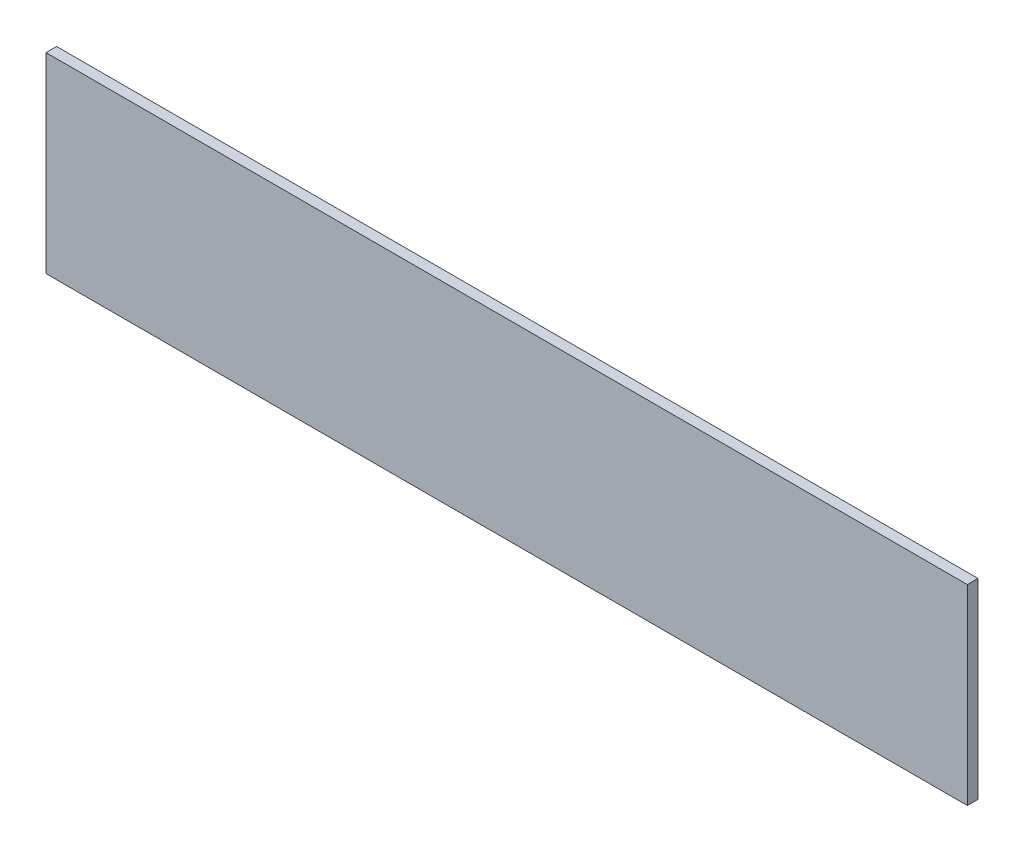
ISO-10303-21;
HEADER;
FILE_DESCRIPTION(('STEP AP214'),'2;1');
FILE_NAME('part.step','',(''),(''),'','','');
FILE_SCHEMA(('AUTOMOTIVE_DESIGN { 1 0 10303 214 1 1 1 1 }'));
ENDSEC;
DATA;
#1=APPLICATION_CONTEXT('core data for automotive mechanical design processes');
#2=APPLICATION_PROTOCOL_DEFINITION('international standard','automotive_design',2000,#1);
#3=PRODUCT_CONTEXT('',#1,'mechanical');
#4=PRODUCT('Part','Part','',(#3));
#5=PRODUCT_RELATED_PRODUCT_CATEGORY('part','',(#4));
#6=PRODUCT_DEFINITION_FORMATION('','',#4);
#7=PRODUCT_DEFINITION_CONTEXT('part definition',#1,'design');
#8=PRODUCT_DEFINITION('design','',#6,#7);
#9=PRODUCT_DEFINITION_SHAPE('','',#8);
#10=(LENGTH_UNIT() NAMED_UNIT(*) SI_UNIT(.MILLI.,.METRE.));
#11=(NAMED_UNIT(*) PLANE_ANGLE_UNIT() SI_UNIT($,.RADIAN.));
#12=(NAMED_UNIT(*) SI_UNIT($,.STERADIAN.) SOLID_ANGLE_UNIT());
#13=UNCERTAINTY_MEASURE_WITH_UNIT(LENGTH_MEASURE(1.E-05),#10,'distance_accuracy_value','');
#14=(GEOMETRIC_REPRESENTATION_CONTEXT(3) GLOBAL_UNCERTAINTY_ASSIGNED_CONTEXT((#13)) GLOBAL_UNIT_ASSIGNED_CONTEXT((#10,
#11,#12)) REPRESENTATION_CONTEXT('',''));
#15=CARTESIAN_POINT('',(0.,0.,0.));
#16=DIRECTION('',(0.,0.,1.));
#17=DIRECTION('',(1.,0.,0.));
#18=AXIS2_PLACEMENT_3D('',#15,#16,#17);
#19=CARTESIAN_POINT('',(0.,0.,3.));
#20=DIRECTION('',(1.,0.,0.));
#21=DIRECTION('',(0.,1.,0.));
#22=AXIS2_PLACEMENT_3D('',#19,#20,#21);
#23=PLANE('',#22);
#24=DIRECTION('',(0.,-1.,0.));
#25=VECTOR('',#24,1.);
#26=CARTESIAN_POINT('',(0.,0.,0.));
#27=LINE('',#26,#25);
#28=CARTESIAN_POINT('',(0.,0.,0.));
#29=VERTEX_POINT('',#28);
#30=CARTESIAN_POINT('',(0.,-54.,0.));
#31=VERTEX_POINT('',#30);
#32=EDGE_CURVE('E96',#29,#31,#27,.T.);
#33=ORIENTED_EDGE('',*,*,#32,.T.);
#34=DIRECTION('',(0.,0.,-1.));
#35=VECTOR('',#34,1.);
#36=CARTESIAN_POINT('',(0.,-54.,3.));
#37=LINE('',#36,#35);
#38=CARTESIAN_POINT('',(0.,-54.,3.));
#39=VERTEX_POINT('',#38);
#40=EDGE_CURVE('E11',#39,#31,#37,.T.);
#41=ORIENTED_EDGE('',*,*,#40,.F.);
#42=DIRECTION('',(0.,-1.,0.));
#43=VECTOR('',#42,1.);
#44=CARTESIAN_POINT('',(0.,0.,3.));
#45=LINE('',#44,#43);
#46=CARTESIAN_POINT('',(0.,0.,3.));
#47=VERTEX_POINT('',#46);
#48=EDGE_CURVE('E84',#47,#39,#45,.T.);
#49=ORIENTED_EDGE('',*,*,#48,.F.);
#50=DIRECTION('',(0.,0.,-1.));
#51=VECTOR('',#50,1.);
#52=CARTESIAN_POINT('',(0.,0.,3.));
#53=LINE('',#52,#51);
#54=EDGE_CURVE('E92',#47,#29,#53,.T.);
#55=ORIENTED_EDGE('',*,*,#54,.T.);
#56=EDGE_LOOP('',(#33,#41,#49,#55));
#57=FACE_BOUND('',#56,.T.);
#58=ADVANCED_FACE('F33',(#57),#23,.F.);
#59=CARTESIAN_POINT('',(0.,-54.,3.));
#60=DIRECTION('',(0.,1.,0.));
#61=DIRECTION('',(-1.,0.,0.));
#62=AXIS2_PLACEMENT_3D('',#59,#60,#61);
#63=PLANE('',#62);
#64=DIRECTION('',(1.,0.,0.));
#65=VECTOR('',#64,1.);
#66=CARTESIAN_POINT('',(0.,-54.,0.));
#67=LINE('',#66,#65);
#68=CARTESIAN_POINT('',(260.,-54.,0.));
#69=VERTEX_POINT('',#68);
#70=EDGE_CURVE('E88',#31,#69,#67,.T.);
#71=ORIENTED_EDGE('',*,*,#70,.T.);
#72=DIRECTION('',(0.,0.,-1.));
#73=VECTOR('',#72,1.);
#74=CARTESIAN_POINT('',(260.,-54.,3.));
#75=LINE('',#74,#73);
#76=CARTESIAN_POINT('',(260.,-54.,3.));
#77=VERTEX_POINT('',#76);
#78=EDGE_CURVE('E41',#77,#69,#75,.T.);
#79=ORIENTED_EDGE('',*,*,#78,.F.);
#80=DIRECTION('',(1.,0.,0.));
#81=VECTOR('',#80,1.);
#82=CARTESIAN_POINT('',(0.,-54.,3.));
#83=LINE('',#82,#81);
#84=EDGE_CURVE('E79',#39,#77,#83,.T.);
#85=ORIENTED_EDGE('',*,*,#84,.F.);
#86=ORIENTED_EDGE('',*,*,#40,.T.);
#87=EDGE_LOOP('',(#71,#79,#85,#86));
#88=FACE_BOUND('',#87,.T.);
#89=ADVANCED_FACE('F87',(#88),#63,.F.);
#90=CARTESIAN_POINT('',(260.,0.,3.));
#91=DIRECTION('',(-1.,0.,0.));
#92=DIRECTION('',(0.,0.,1.));
#93=AXIS2_PLACEMENT_3D('',#90,#91,#92);
#94=PLANE('',#93);
#95=DIRECTION('',(0.,1.,0.));
#96=VECTOR('',#95,1.);
#97=CARTESIAN_POINT('',(260.,0.,0.));
#98=LINE('',#97,#96);
#99=CARTESIAN_POINT('',(260.,0.,0.));
#100=VERTEX_POINT('',#99);
#101=EDGE_CURVE('E66',#69,#100,#98,.T.);
#102=ORIENTED_EDGE('',*,*,#101,.T.);
#103=DIRECTION('',(0.,0.,-1.));
#104=VECTOR('',#103,1.);
#105=CARTESIAN_POINT('',(260.,0.,3.));
#106=LINE('',#105,#104);
#107=CARTESIAN_POINT('',(260.,0.,3.));
#108=VERTEX_POINT('',#107);
#109=EDGE_CURVE('E89',#108,#100,#106,.T.);
#110=ORIENTED_EDGE('',*,*,#109,.F.);
#111=DIRECTION('',(0.,1.,0.));
#112=VECTOR('',#111,1.);
#113=CARTESIAN_POINT('',(260.,0.,3.));
#114=LINE('',#113,#112);
#115=EDGE_CURVE('E82',#77,#108,#114,.T.);
#116=ORIENTED_EDGE('',*,*,#115,.F.);
#117=ORIENTED_EDGE('',*,*,#78,.T.);
#118=EDGE_LOOP('',(#102,#110,#116,#117));
#119=FACE_BOUND('',#118,.T.);
#120=ADVANCED_FACE('F90',(#119),#94,.F.);
#121=CARTESIAN_POINT('',(0.,0.,3.));
#122=DIRECTION('',(0.,-1.,0.));
#123=DIRECTION('',(0.,0.,-1.));
#124=AXIS2_PLACEMENT_3D('',#121,#122,#123);
#125=PLANE('',#124);
#126=DIRECTION('',(-1.,0.,0.));
#127=VECTOR('',#126,1.);
#128=CARTESIAN_POINT('',(0.,0.,0.));
#129=LINE('',#128,#127);
#130=EDGE_CURVE('E72',#100,#29,#129,.T.);
#131=ORIENTED_EDGE('',*,*,#130,.T.);
#132=ORIENTED_EDGE('',*,*,#54,.F.);
#133=DIRECTION('',(-1.,0.,0.));
#134=VECTOR('',#133,1.);
#135=CARTESIAN_POINT('',(0.,0.,3.));
#136=LINE('',#135,#134);
#137=EDGE_CURVE('E49',#108,#47,#136,.T.);
#138=ORIENTED_EDGE('',*,*,#137,.F.);
#139=ORIENTED_EDGE('',*,*,#109,.T.);
#140=EDGE_LOOP('',(#131,#132,#138,#139));
#141=FACE_BOUND('',#140,.T.);
#142=ADVANCED_FACE('F103',(#141),#125,.F.);
#143=CARTESIAN_POINT('',(0.,0.,3.));
#144=DIRECTION('',(0.,0.,1.));
#145=DIRECTION('',(1.,0.,0.));
#146=AXIS2_PLACEMENT_3D('',#143,#144,#145);
#147=PLANE('',#146);
#148=ORIENTED_EDGE('',*,*,#48,.T.);
#149=ORIENTED_EDGE('',*,*,#84,.T.);
#150=ORIENTED_EDGE('',*,*,#115,.T.);
#151=ORIENTED_EDGE('',*,*,#137,.T.);
#152=EDGE_LOOP('',(#148,#149,#150,#151));
#153=FACE_BOUND('',#152,.T.);
#154=ADVANCED_FACE('F80',(#153),#147,.T.);
#155=CARTESIAN_POINT('',(0.,0.,0.));
#156=DIRECTION('',(0.,0.,1.));
#157=DIRECTION('',(1.,0.,0.));
#158=AXIS2_PLACEMENT_3D('',#155,#156,#157);
#159=PLANE('',#158);
#160=ORIENTED_EDGE('',*,*,#32,.F.);
#161=ORIENTED_EDGE('',*,*,#130,.F.);
#162=ORIENTED_EDGE('',*,*,#101,.F.);
#163=ORIENTED_EDGE('',*,*,#70,.F.);
#164=EDGE_LOOP('',(#160,#161,#162,#163));
#165=FACE_BOUND('',#164,.T.);
#166=ADVANCED_FACE('F106',(#165),#159,.F.);
#167=CLOSED_SHELL('',(#58,#89,#120,#142,#154,#166));
#168=MANIFOLD_SOLID_BREP('B2',#167);
#169=ADVANCED_BREP_SHAPE_REPRESENTATION('',(#18,#168),#14);
#170=SHAPE_DEFINITION_REPRESENTATION(#9,#169);
ENDSEC;
END-ISO-10303-21;
